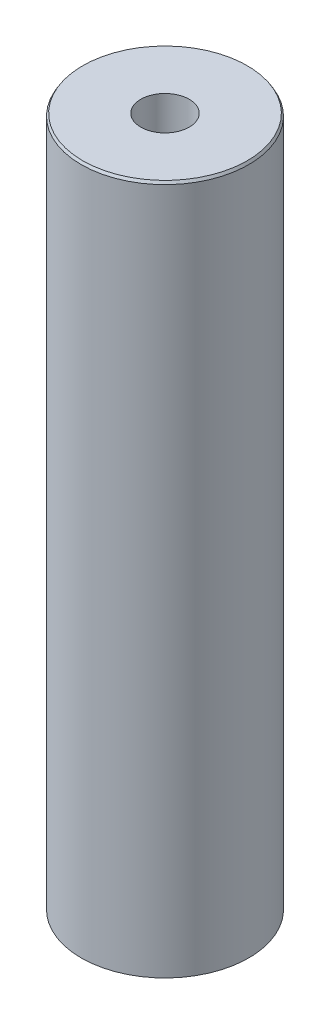
ISO-10303-21;
HEADER;
FILE_DESCRIPTION(('STEP AP214'),'2;1');
FILE_NAME('part.step','',(''),(''),'','','');
FILE_SCHEMA(('AUTOMOTIVE_DESIGN { 1 0 10303 214 1 1 1 1 }'));
ENDSEC;
DATA;
#1=APPLICATION_CONTEXT('core data for automotive mechanical design processes');
#2=APPLICATION_PROTOCOL_DEFINITION('international standard','automotive_design',2000,#1);
#3=PRODUCT_CONTEXT('',#1,'mechanical');
#4=PRODUCT('Part','Part','',(#3));
#5=PRODUCT_RELATED_PRODUCT_CATEGORY('part','',(#4));
#6=PRODUCT_DEFINITION_FORMATION('','',#4);
#7=PRODUCT_DEFINITION_CONTEXT('part definition',#1,'design');
#8=PRODUCT_DEFINITION('design','',#6,#7);
#9=PRODUCT_DEFINITION_SHAPE('','',#8);
#10=(LENGTH_UNIT() NAMED_UNIT(*) SI_UNIT(.MILLI.,.METRE.));
#11=(NAMED_UNIT(*) PLANE_ANGLE_UNIT() SI_UNIT($,.RADIAN.));
#12=(NAMED_UNIT(*) SI_UNIT($,.STERADIAN.) SOLID_ANGLE_UNIT());
#13=UNCERTAINTY_MEASURE_WITH_UNIT(LENGTH_MEASURE(1.E-05),#10,'distance_accuracy_value','');
#14=(GEOMETRIC_REPRESENTATION_CONTEXT(3) GLOBAL_UNCERTAINTY_ASSIGNED_CONTEXT((#13)) GLOBAL_UNIT_ASSIGNED_CONTEXT((#10,
#11,#12)) REPRESENTATION_CONTEXT('',''));
#15=CARTESIAN_POINT('',(0.,0.,0.));
#16=DIRECTION('',(0.,0.,1.));
#17=DIRECTION('',(1.,0.,0.));
#18=AXIS2_PLACEMENT_3D('',#15,#16,#17);
#19=CARTESIAN_POINT('',(0.,247.376403995987,0.));
#20=DIRECTION('',(0.,-1.,0.));
#21=DIRECTION('',(0.,0.,-1.));
#22=AXIS2_PLACEMENT_3D('',#19,#20,#21);
#23=CYLINDRICAL_SURFACE('',#22,30.);
#24=CARTESIAN_POINT('',(0.,246.441204442453,0.));
#25=DIRECTION('',(0.,1.,0.));
#26=DIRECTION('',(0.,0.,1.));
#27=AXIS2_PLACEMENT_3D('',#24,#25,#26);
#28=CIRCLE('',#27,30.);
#29=CARTESIAN_POINT('',(0.,246.441204442453,30.));
#30=VERTEX_POINT('',#29);
#31=EDGE_CURVE('E50',#30,#30,#28,.F.);
#32=ORIENTED_EDGE('',*,*,#31,.T.);
#33=EDGE_LOOP('',(#32));
#34=FACE_BOUND('',#33,.T.);
#35=CARTESIAN_POINT('',(0.,0.53993771397895,0.));
#36=DIRECTION('',(0.,1.,0.));
#37=DIRECTION('',(0.,0.,1.));
#38=AXIS2_PLACEMENT_3D('',#35,#36,#37);
#39=CIRCLE('',#38,30.);
#40=CARTESIAN_POINT('',(0.,0.53993771397895,30.));
#41=VERTEX_POINT('',#40);
#42=EDGE_CURVE('E51',#41,#41,#39,.T.);
#43=ORIENTED_EDGE('',*,*,#42,.T.);
#44=EDGE_LOOP('',(#43));
#45=FACE_BOUND('',#44,.T.);
#46=ADVANCED_FACE('F39',(#34,#45),#23,.T.);
#47=CARTESIAN_POINT('',(0.,247.376403995987,0.));
#48=DIRECTION('',(0.,1.,0.));
#49=DIRECTION('',(0.,0.,1.));
#50=AXIS2_PLACEMENT_3D('',#47,#48,#49);
#51=PLANE('',#50);
#52=CARTESIAN_POINT('',(0.,247.376403995987,0.));
#53=DIRECTION('',(0.,1.,0.));
#54=DIRECTION('',(0.,0.,1.));
#55=AXIS2_PLACEMENT_3D('',#52,#53,#54);
#56=CIRCLE('',#55,29.460062286021);
#57=CARTESIAN_POINT('',(0.,247.376403995987,29.460062286021));
#58=VERTEX_POINT('',#57);
#59=EDGE_CURVE('E54',#58,#58,#56,.T.);
#60=ORIENTED_EDGE('',*,*,#59,.T.);
#61=EDGE_LOOP('',(#60));
#62=FACE_BOUND('',#61,.T.);
#63=CARTESIAN_POINT('',(0.,247.376403995987,0.));
#64=DIRECTION('',(0.,1.,0.));
#65=DIRECTION('',(0.,0.,1.));
#66=AXIS2_PLACEMENT_3D('',#63,#64,#65);
#67=CIRCLE('',#66,8.66512220298749);
#68=CARTESIAN_POINT('',(0.,247.376403995987,8.66512220298749));
#69=VERTEX_POINT('',#68);
#70=EDGE_CURVE('E58',#69,#69,#67,.T.);
#71=ORIENTED_EDGE('',*,*,#70,.F.);
#72=EDGE_LOOP('',(#71));
#73=FACE_BOUND('',#72,.T.);
#74=ADVANCED_FACE('F69',(#62,#73),#51,.T.);
#75=CARTESIAN_POINT('',(0.,0.,0.));
#76=DIRECTION('',(0.,1.,0.));
#77=DIRECTION('',(0.,0.,1.));
#78=AXIS2_PLACEMENT_3D('',#75,#76,#77);
#79=PLANE('',#78);
#80=CARTESIAN_POINT('',(0.,0.,0.));
#81=DIRECTION('',(0.,1.,0.));
#82=DIRECTION('',(0.,0.,1.));
#83=AXIS2_PLACEMENT_3D('',#80,#81,#82);
#84=CIRCLE('',#83,29.0648004464659);
#85=CARTESIAN_POINT('',(0.,0.,29.0648004464659));
#86=VERTEX_POINT('',#85);
#87=EDGE_CURVE('E10',#86,#86,#84,.F.);
#88=ORIENTED_EDGE('',*,*,#87,.T.);
#89=EDGE_LOOP('',(#88));
#90=FACE_BOUND('',#89,.T.);
#91=CARTESIAN_POINT('',(0.,0.,0.));
#92=DIRECTION('',(0.,1.,0.));
#93=DIRECTION('',(0.,0.,1.));
#94=AXIS2_PLACEMENT_3D('',#91,#92,#93);
#95=CIRCLE('',#94,8.66512220298749);
#96=CARTESIAN_POINT('',(0.,0.,8.66512220298749));
#97=VERTEX_POINT('',#96);
#98=EDGE_CURVE('E63',#97,#97,#95,.T.);
#99=ORIENTED_EDGE('',*,*,#98,.T.);
#100=EDGE_LOOP('',(#99));
#101=FACE_BOUND('',#100,.T.);
#102=ADVANCED_FACE('F75',(#90,#101),#79,.F.);
#103=CARTESIAN_POINT('',(0.,247.376403995987,0.));
#104=DIRECTION('',(0.,-1.,0.));
#105=DIRECTION('',(0.,0.,-1.));
#106=AXIS2_PLACEMENT_3D('',#103,#104,#105);
#107=CYLINDRICAL_SURFACE('',#106,8.66512220298749);
#108=ORIENTED_EDGE('',*,*,#70,.T.);
#109=EDGE_LOOP('',(#108));
#110=FACE_BOUND('',#109,.T.);
#111=ORIENTED_EDGE('',*,*,#98,.F.);
#112=EDGE_LOOP('',(#111));
#113=FACE_BOUND('',#112,.T.);
#114=ADVANCED_FACE('F70',(#110,#113),#107,.F.);
#115=CARTESIAN_POINT('',(0.,247.376403995987,0.));
#116=DIRECTION('',(0.,-1.,0.));
#117=DIRECTION('',(0.,0.,-1.));
#118=AXIS2_PLACEMENT_3D('',#115,#116,#117);
#119=CONICAL_SURFACE('',#118,29.460062286021,0.52359877559826);
#120=ORIENTED_EDGE('',*,*,#31,.F.);
#121=EDGE_LOOP('',(#120));
#122=FACE_BOUND('',#121,.T.);
#123=ORIENTED_EDGE('',*,*,#59,.F.);
#124=EDGE_LOOP('',(#123));
#125=FACE_BOUND('',#124,.T.);
#126=ADVANCED_FACE('F81',(#122,#125),#119,.T.);
#127=CARTESIAN_POINT('',(0.,0.53993771397895,0.));
#128=DIRECTION('',(0.,1.,0.));
#129=DIRECTION('',(0.,0.,1.));
#130=AXIS2_PLACEMENT_3D('',#127,#128,#129);
#131=CONICAL_SURFACE('',#130,30.,1.0471975511966);
#132=ORIENTED_EDGE('',*,*,#87,.F.);
#133=EDGE_LOOP('',(#132));
#134=FACE_BOUND('',#133,.T.);
#135=ORIENTED_EDGE('',*,*,#42,.F.);
#136=EDGE_LOOP('',(#135));
#137=FACE_BOUND('',#136,.T.);
#138=ADVANCED_FACE('F45',(#134,#137),#131,.T.);
#139=CLOSED_SHELL('',(#46,#74,#102,#114,#126,#138));
#140=MANIFOLD_SOLID_BREP('B2',#139);
#141=ADVANCED_BREP_SHAPE_REPRESENTATION('',(#18,#140),#14);
#142=SHAPE_DEFINITION_REPRESENTATION(#9,#141);
ENDSEC;
END-ISO-10303-21;
